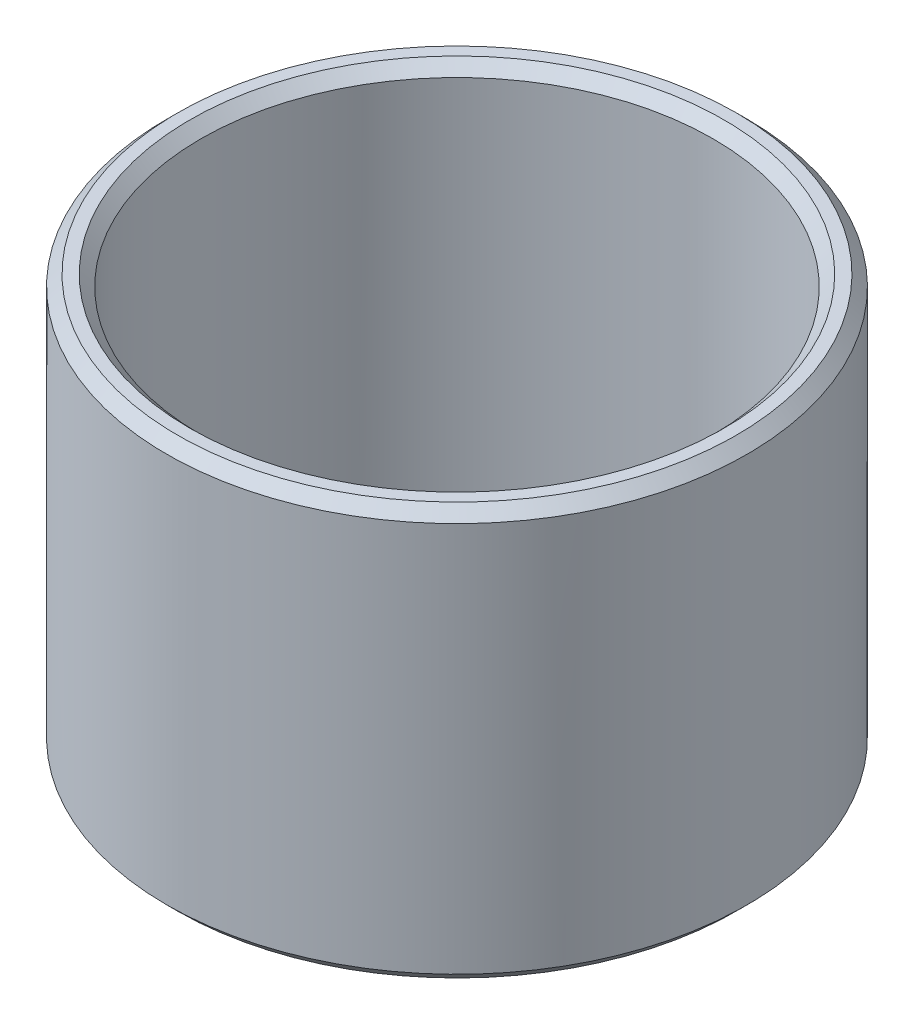
ISO-10303-21;
HEADER;
FILE_DESCRIPTION(('STEP AP214'),'2;1');
FILE_NAME('part.step','',(''),(''),'','','');
FILE_SCHEMA(('AUTOMOTIVE_DESIGN { 1 0 10303 214 1 1 1 1 }'));
ENDSEC;
DATA;
#1=APPLICATION_CONTEXT('core data for automotive mechanical design processes');
#2=APPLICATION_PROTOCOL_DEFINITION('international standard','automotive_design',2000,#1);
#3=PRODUCT_CONTEXT('',#1,'mechanical');
#4=PRODUCT('Part','Part','',(#3));
#5=PRODUCT_RELATED_PRODUCT_CATEGORY('part','',(#4));
#6=PRODUCT_DEFINITION_FORMATION('','',#4);
#7=PRODUCT_DEFINITION_CONTEXT('part definition',#1,'design');
#8=PRODUCT_DEFINITION('design','',#6,#7);
#9=PRODUCT_DEFINITION_SHAPE('','',#8);
#10=(LENGTH_UNIT() NAMED_UNIT(*) SI_UNIT(.MILLI.,.METRE.));
#11=(NAMED_UNIT(*) PLANE_ANGLE_UNIT() SI_UNIT($,.RADIAN.));
#12=(NAMED_UNIT(*) SI_UNIT($,.STERADIAN.) SOLID_ANGLE_UNIT());
#13=UNCERTAINTY_MEASURE_WITH_UNIT(LENGTH_MEASURE(1.E-05),#10,'distance_accuracy_value','');
#14=(GEOMETRIC_REPRESENTATION_CONTEXT(3) GLOBAL_UNCERTAINTY_ASSIGNED_CONTEXT((#13)) GLOBAL_UNIT_ASSIGNED_CONTEXT((#10,
#11,#12)) REPRESENTATION_CONTEXT('',''));
#15=CARTESIAN_POINT('',(0.,0.,0.));
#16=DIRECTION('',(0.,0.,1.));
#17=DIRECTION('',(1.,0.,0.));
#18=AXIS2_PLACEMENT_3D('',#15,#16,#17);
#19=CARTESIAN_POINT('',(0.,70.9984744755506,0.));
#20=DIRECTION('',(0.,-1.,0.));
#21=DIRECTION('',(0.,0.,-1.));
#22=AXIS2_PLACEMENT_3D('',#19,#20,#21);
#23=CYLINDRICAL_SURFACE('',#22,50.);
#24=CARTESIAN_POINT('',(0.,1.88484915004038,0.));
#25=DIRECTION('',(0.,1.,0.));
#26=DIRECTION('',(0.,0.,1.));
#27=AXIS2_PLACEMENT_3D('',#24,#25,#26);
#28=CIRCLE('',#27,50.);
#29=CARTESIAN_POINT('',(0.,1.88484915004038,50.));
#30=VERTEX_POINT('',#29);
#31=EDGE_CURVE('E10',#30,#30,#28,.T.);
#32=ORIENTED_EDGE('',*,*,#31,.T.);
#33=EDGE_LOOP('',(#32));
#34=FACE_BOUND('',#33,.T.);
#35=CARTESIAN_POINT('',(0.,69.1136253255102,0.));
#36=DIRECTION('',(0.,1.,0.));
#37=DIRECTION('',(0.,0.,1.));
#38=AXIS2_PLACEMENT_3D('',#35,#36,#37);
#39=CIRCLE('',#38,50.);
#40=CARTESIAN_POINT('',(0.,69.1136253255102,-50.));
#41=VERTEX_POINT('',#40);
#42=EDGE_CURVE('E50',#41,#41,#39,.F.);
#43=ORIENTED_EDGE('',*,*,#42,.T.);
#44=EDGE_LOOP('',(#43));
#45=FACE_BOUND('',#44,.T.);
#46=ADVANCED_FACE('F39',(#34,#45),#23,.T.);
#47=CARTESIAN_POINT('',(0.,70.9984744755506,0.));
#48=DIRECTION('',(0.,1.,0.));
#49=DIRECTION('',(0.,0.,1.));
#50=AXIS2_PLACEMENT_3D('',#47,#48,#49);
#51=PLANE('',#50);
#52=CARTESIAN_POINT('',(0.,70.9984744755506,0.));
#53=DIRECTION('',(0.,1.,0.));
#54=DIRECTION('',(0.,0.,1.));
#55=AXIS2_PLACEMENT_3D('',#52,#53,#54);
#56=CIRCLE('',#55,46.0154543421442);
#57=CARTESIAN_POINT('',(0.,70.9984744755506,46.0154543421442));
#58=VERTEX_POINT('',#57);
#59=EDGE_CURVE('E58',#58,#58,#56,.F.);
#60=ORIENTED_EDGE('',*,*,#59,.T.);
#61=EDGE_LOOP('',(#60));
#62=FACE_BOUND('',#61,.T.);
#63=CARTESIAN_POINT('',(0.,70.9984744755506,0.));
#64=DIRECTION('',(0.,1.,0.));
#65=DIRECTION('',(0.,0.,1.));
#66=AXIS2_PLACEMENT_3D('',#63,#64,#65);
#67=CIRCLE('',#66,48.1151508499596);
#68=CARTESIAN_POINT('',(0.,70.9984744755506,-48.1151508499596));
#69=VERTEX_POINT('',#68);
#70=EDGE_CURVE('E61',#69,#69,#67,.T.);
#71=ORIENTED_EDGE('',*,*,#70,.T.);
#72=EDGE_LOOP('',(#71));
#73=FACE_BOUND('',#72,.T.);
#74=ADVANCED_FACE('F88',(#62,#73),#51,.T.);
#75=CARTESIAN_POINT('',(0.,0.,0.));
#76=DIRECTION('',(0.,1.,0.));
#77=DIRECTION('',(0.,0.,1.));
#78=AXIS2_PLACEMENT_3D('',#75,#76,#77);
#79=PLANE('',#78);
#80=CARTESIAN_POINT('',(0.,0.,0.));
#81=DIRECTION('',(0.,1.,0.));
#82=DIRECTION('',(0.,0.,1.));
#83=AXIS2_PLACEMENT_3D('',#80,#81,#82);
#84=CIRCLE('',#83,46.0154543421442);
#85=CARTESIAN_POINT('',(0.,0.,-46.0154543421442));
#86=VERTEX_POINT('',#85);
#87=EDGE_CURVE('E51',#86,#86,#84,.T.);
#88=ORIENTED_EDGE('',*,*,#87,.T.);
#89=EDGE_LOOP('',(#88));
#90=FACE_BOUND('',#89,.T.);
#91=CARTESIAN_POINT('',(0.,0.,0.));
#92=DIRECTION('',(0.,1.,0.));
#93=DIRECTION('',(0.,0.,1.));
#94=AXIS2_PLACEMENT_3D('',#91,#92,#93);
#95=CIRCLE('',#94,48.1151508499596);
#96=CARTESIAN_POINT('',(0.,0.,48.1151508499596));
#97=VERTEX_POINT('',#96);
#98=EDGE_CURVE('E54',#97,#97,#95,.F.);
#99=ORIENTED_EDGE('',*,*,#98,.T.);
#100=EDGE_LOOP('',(#99));
#101=FACE_BOUND('',#100,.T.);
#102=ADVANCED_FACE('F83',(#90,#101),#79,.F.);
#103=CARTESIAN_POINT('',(0.,70.9984744755506,0.));
#104=DIRECTION('',(0.,-1.,0.));
#105=DIRECTION('',(0.,0.,-1.));
#106=AXIS2_PLACEMENT_3D('',#103,#104,#105);
#107=CYLINDRICAL_SURFACE('',#106,44.1306051921038);
#108=CARTESIAN_POINT('',(0.,69.1136253255102,0.));
#109=DIRECTION('',(0.,1.,0.));
#110=DIRECTION('',(0.,0.,1.));
#111=AXIS2_PLACEMENT_3D('',#108,#109,#110);
#112=CIRCLE('',#111,44.1306051921038);
#113=CARTESIAN_POINT('',(0.,69.1136253255102,44.1306051921038));
#114=VERTEX_POINT('',#113);
#115=EDGE_CURVE('E67',#114,#114,#112,.T.);
#116=ORIENTED_EDGE('',*,*,#115,.T.);
#117=EDGE_LOOP('',(#116));
#118=FACE_BOUND('',#117,.T.);
#119=CARTESIAN_POINT('',(0.,1.88484915004039,0.));
#120=DIRECTION('',(0.,1.,0.));
#121=DIRECTION('',(0.,0.,1.));
#122=AXIS2_PLACEMENT_3D('',#119,#120,#121);
#123=CIRCLE('',#122,44.1306051921038);
#124=CARTESIAN_POINT('',(0.,1.88484915004039,-44.1306051921038));
#125=VERTEX_POINT('',#124);
#126=EDGE_CURVE('E69',#125,#125,#123,.F.);
#127=ORIENTED_EDGE('',*,*,#126,.T.);
#128=EDGE_LOOP('',(#127));
#129=FACE_BOUND('',#128,.T.);
#130=ADVANCED_FACE('F71',(#118,#129),#107,.F.);
#131=CARTESIAN_POINT('',(0.,69.1136253255102,0.));
#132=DIRECTION('',(0.,1.,0.));
#133=DIRECTION('',(0.,0.,1.));
#134=AXIS2_PLACEMENT_3D('',#131,#132,#133);
#135=CONICAL_SURFACE('',#134,44.1306051921038,0.78539816339745);
#136=ORIENTED_EDGE('',*,*,#59,.F.);
#137=EDGE_LOOP('',(#136));
#138=FACE_BOUND('',#137,.T.);
#139=ORIENTED_EDGE('',*,*,#115,.F.);
#140=EDGE_LOOP('',(#139));
#141=FACE_BOUND('',#140,.T.);
#142=ADVANCED_FACE('F77',(#138,#141),#135,.F.);
#143=CARTESIAN_POINT('',(0.,0.,0.));
#144=DIRECTION('',(0.,-1.,0.));
#145=DIRECTION('',(0.,0.,-1.));
#146=AXIS2_PLACEMENT_3D('',#143,#144,#145);
#147=CONICAL_SURFACE('',#146,46.0154543421442,0.785398163397447);
#148=CARTESIAN_POINT('',(0.,1.88484915004039,-44.1306051921038));
#149=CARTESIAN_POINT('',(0.,1.86521530472747,-44.1502390374167));
#150=CARTESIAN_POINT('',(0.,1.84558145941455,-44.1698728827296));
#151=CARTESIAN_POINT('',(0.,1.80631376878871,-44.2091405733555));
#152=CARTESIAN_POINT('',(0.,1.78667992347579,-44.2287744186684));
#153=CARTESIAN_POINT('',(0.,1.74741223284995,-44.2680421092942));
#154=CARTESIAN_POINT('',(0.,1.72777838753702,-44.2876759546072));
#155=CARTESIAN_POINT('',(0.,1.68851069691118,-44.326943645233));
#156=CARTESIAN_POINT('',(0.,1.66887685159826,-44.3465774905459));
#157=CARTESIAN_POINT('',(0.,1.62960916097242,-44.3858451811718));
#158=CARTESIAN_POINT('',(0.,1.6099753156595,-44.4054790264847));
#159=CARTESIAN_POINT('',(0.,1.57070762503366,-44.4447467171105));
#160=CARTESIAN_POINT('',(0.,1.55107377972074,-44.4643805624235));
#161=CARTESIAN_POINT('',(0.,1.5118060890949,-44.5036482530493));
#162=CARTESIAN_POINT('',(0.,1.49217224378198,-44.5232820983622));
#163=CARTESIAN_POINT('',(0.,1.45290455315613,-44.5625497889881));
#164=CARTESIAN_POINT('',(0.,1.43327070784321,-44.582183634301));
#165=CARTESIAN_POINT('',(0.,1.39400301721737,-44.6214513249268));
#166=CARTESIAN_POINT('',(0.,1.37436917190445,-44.6410851702397));
#167=CARTESIAN_POINT('',(0.,1.33510148127861,-44.6803528608656));
#168=CARTESIAN_POINT('',(0.,1.31546763596569,-44.6999867061785));
#169=CARTESIAN_POINT('',(0.,1.27619994533985,-44.7392543968043));
#170=CARTESIAN_POINT('',(0.,1.25656610002693,-44.7588882421173));
#171=CARTESIAN_POINT('',(0.,1.21729840940109,-44.7981559327431));
#172=CARTESIAN_POINT('',(0.,1.19766456408817,-44.817789778056));
#173=CARTESIAN_POINT('',(0.,1.15839687346232,-44.8570574686819));
#174=CARTESIAN_POINT('',(0.,1.1387630281494,-44.8766913139948));
#175=CARTESIAN_POINT('',(0.,1.09949533752356,-44.9159590046206));
#176=CARTESIAN_POINT('',(0.,1.07986149221064,-44.9355928499335));
#177=CARTESIAN_POINT('',(0.,1.0405938015848,-44.9748605405594));
#178=CARTESIAN_POINT('',(0.,1.02095995627188,-44.9944943858723));
#179=CARTESIAN_POINT('',(0.,0.981692265646036,-45.0337620764982));
#180=CARTESIAN_POINT('',(0.,0.962058420333115,-45.0533959218111));
#181=CARTESIAN_POINT('',(0.,0.922790729707274,-45.0926636124369));
#182=CARTESIAN_POINT('',(0.,0.903156884394354,-45.1122974577498));
#183=CARTESIAN_POINT('',(0.,0.863889193768513,-45.1515651483757));
#184=CARTESIAN_POINT('',(0.,0.844255348455591,-45.1711989936886));
#185=CARTESIAN_POINT('',(0.,0.80498765782975,-45.2104666843144));
#186=CARTESIAN_POINT('',(0.,0.78535381251683,-45.2301005296274));
#187=CARTESIAN_POINT('',(0.,0.746086121890988,-45.2693682202532));
#188=CARTESIAN_POINT('',(0.,0.726452276578067,-45.2890020655661));
#189=CARTESIAN_POINT('',(0.,0.687184585952225,-45.328269756192));
#190=CARTESIAN_POINT('',(0.,0.667550740639306,-45.3479036015049));
#191=CARTESIAN_POINT('',(0.,0.628283050013464,-45.3871712921307));
#192=CARTESIAN_POINT('',(0.,0.608649204700542,-45.4068051374436));
#193=CARTESIAN_POINT('',(0.,0.569381514074701,-45.4460728280695));
#194=CARTESIAN_POINT('',(0.,0.549747668761781,-45.4657066733824));
#195=CARTESIAN_POINT('',(0.,0.51047997813594,-45.5049743640082));
#196=CARTESIAN_POINT('',(0.,0.490846132823018,-45.5246082093212));
#197=CARTESIAN_POINT('',(0.,0.451578442197176,-45.563875899947));
#198=CARTESIAN_POINT('',(0.,0.431944596884257,-45.5835097452599));
#199=CARTESIAN_POINT('',(0.,0.392676906258415,-45.6227774358858));
#200=CARTESIAN_POINT('',(0.,0.373043060945493,-45.6424112811987));
#201=CARTESIAN_POINT('',(0.,0.333775370319652,-45.6816789718245));
#202=CARTESIAN_POINT('',(0.,0.314141525006732,-45.7013128171375));
#203=CARTESIAN_POINT('',(0.,0.274873834380891,-45.7405805077633));
#204=CARTESIAN_POINT('',(0.,0.255239989067969,-45.7602143530762));
#205=CARTESIAN_POINT('',(0.,0.215972298442128,-45.7994820437021));
#206=CARTESIAN_POINT('',(0.,0.196338453129208,-45.819115889015));
#207=CARTESIAN_POINT('',(0.,0.157070762503366,-45.8583835796408));
#208=CARTESIAN_POINT('',(0.,0.137436917190445,-45.8780174249537));
#209=CARTESIAN_POINT('',(0.,0.0981692265646029,-45.9172851155796));
#210=CARTESIAN_POINT('',(0.,0.0785353812516829,-45.9369189608925));
#211=CARTESIAN_POINT('',(0.,0.0392676906258427,-45.9761866515183));
#212=CARTESIAN_POINT('',(0.,0.0196338453129226,-45.9958204968313));
#213=CARTESIAN_POINT('',(0.,0.,-46.0154543421442));
#214=B_SPLINE_CURVE_WITH_KNOTS('',3,(#148,#149,#150,#151,#152,#153,#154,#155,#156,#157,#158,
#159,#160,#161,#162,#163,#164,#165,#166,#167,#168,#169,#170,#171,#172,#173,#174,#175,#176,#177,
#178,#179,#180,#181,#182,#183,#184,#185,#186,#187,#188,#189,#190,#191,#192,#193,#194,#195,#196,
#197,#198,#199,#200,#201,#202,#203,#204,#205,#206,#207,#208,#209,#210,#211,#212,#213),
.UNSPECIFIED.,.F.,.F.,(4,2,2,2,2,2,2,2,2,2,2,2,2,2,2,2,2,2,2,2,2,2,2,2,2,2,2,2,2,2,2,2,4),(0.,
0.0832993509692013,0.166598701938408,0.249898052907609,0.333197403876815,0.416496754846017,
0.499796105815223,0.583095456784424,0.66639480775363,0.749694158722832,0.832993509692038,
0.916292860661239,0.999592211630445,1.08289156259965,1.16619091356885,1.24949026453805,
1.33278961550726,1.41608896647646,1.49938831744566,1.58268766841487,1.66598701938407,
1.74928637035328,1.83258572132248,1.91588507229168,1.99918442326089,2.08248377423009,
2.16578312519929,2.2490824761685,2.3323818271377,2.41568117810691,2.49898052907611,
2.58227988004531,2.66557923101452),.UNSPECIFIED.);
#215=EDGE_CURVE('BSEAM73',#125,#86,#214,.T.);
#216=ORIENTED_EDGE('',*,*,#126,.F.);
#217=ORIENTED_EDGE('',*,*,#87,.F.);
#218=ORIENTED_EDGE('',*,*,#215,.T.);
#219=ORIENTED_EDGE('',*,*,#215,.F.);
#220=EDGE_LOOP('',(#216,#218,#217,#219));
#221=FACE_BOUND('',#220,.T.);
#222=ADVANCED_FACE('F73',(#221),#147,.F.);
#223=CARTESIAN_POINT('',(0.,1.88484915004038,0.));
#224=DIRECTION('',(0.,1.,0.));
#225=DIRECTION('',(0.,0.,1.));
#226=AXIS2_PLACEMENT_3D('',#223,#224,#225);
#227=CONICAL_SURFACE('',#226,50.,0.78539816339745);
#228=ORIENTED_EDGE('',*,*,#98,.F.);
#229=EDGE_LOOP('',(#228));
#230=FACE_BOUND('',#229,.T.);
#231=ORIENTED_EDGE('',*,*,#31,.F.);
#232=EDGE_LOOP('',(#231));
#233=FACE_BOUND('',#232,.T.);
#234=ADVANCED_FACE('F76',(#230,#233),#227,.T.);
#235=CARTESIAN_POINT('',(0.,70.9984744755506,0.));
#236=DIRECTION('',(0.,-1.,0.));
#237=DIRECTION('',(0.,0.,-1.));
#238=AXIS2_PLACEMENT_3D('',#235,#236,#237);
#239=CONICAL_SURFACE('',#238,48.1151508499596,0.785398163397447);
#240=CARTESIAN_POINT('',(0.,69.1136253255102,-50.));
#241=CARTESIAN_POINT('',(0.,69.1332591708231,-49.9803661546871));
#242=CARTESIAN_POINT('',(0.,69.152893016136,-49.9607323093742));
#243=CARTESIAN_POINT('',(0.,69.1921607067619,-49.9214646187483));
#244=CARTESIAN_POINT('',(0.,69.2117945520748,-49.9018307734354));
#245=CARTESIAN_POINT('',(0.,69.2510622427006,-49.8625630828096));
#246=CARTESIAN_POINT('',(0.,69.2706960880136,-49.8429292374966));
#247=CARTESIAN_POINT('',(0.,69.3099637786394,-49.8036615468708));
#248=CARTESIAN_POINT('',(0.,69.3295976239523,-49.7840277015579));
#249=CARTESIAN_POINT('',(0.,69.3688653145781,-49.744760010932));
#250=CARTESIAN_POINT('',(0.,69.3884991598911,-49.7251261656191));
#251=CARTESIAN_POINT('',(0.,69.4277668505169,-49.6858584749933));
#252=CARTESIAN_POINT('',(0.,69.4474006958298,-49.6662246296804));
#253=CARTESIAN_POINT('',(0.,69.4866683864557,-49.6269569390545));
#254=CARTESIAN_POINT('',(0.,69.5063022317686,-49.6073230937416));
#255=CARTESIAN_POINT('',(0.,69.5455699223944,-49.5680554031158));
#256=CARTESIAN_POINT('',(0.,69.5652037677073,-49.5484215578028));
#257=CARTESIAN_POINT('',(0.,69.6044714583332,-49.509153867177));
#258=CARTESIAN_POINT('',(0.,69.6241053036461,-49.4895200218641));
#259=CARTESIAN_POINT('',(0.,69.663372994272,-49.4502523312382));
#260=CARTESIAN_POINT('',(0.,69.6830068395849,-49.4306184859253));
#261=CARTESIAN_POINT('',(0.,69.7222745302107,-49.3913507952995));
#262=CARTESIAN_POINT('',(0.,69.7419083755236,-49.3717169499865));
#263=CARTESIAN_POINT('',(0.,69.7811760661495,-49.3324492593607));
#264=CARTESIAN_POINT('',(0.,69.8008099114624,-49.3128154140478));
#265=CARTESIAN_POINT('',(0.,69.8400776020882,-49.2735477234219));
#266=CARTESIAN_POINT('',(0.,69.8597114474012,-49.253913878109));
#267=CARTESIAN_POINT('',(0.,69.898979138027,-49.2146461874832));
#268=CARTESIAN_POINT('',(0.,69.9186129833399,-49.1950123421703));
#269=CARTESIAN_POINT('',(0.,69.9578806739658,-49.1557446515444));
#270=CARTESIAN_POINT('',(0.,69.9775145192787,-49.1361108062315));
#271=CARTESIAN_POINT('',(0.,70.0167822099045,-49.0968431156057));
#272=CARTESIAN_POINT('',(0.,70.0364160552174,-49.0772092702927));
#273=CARTESIAN_POINT('',(0.,70.0756837458433,-49.0379415796669));
#274=CARTESIAN_POINT('',(0.,70.0953175911562,-49.018307734354));
#275=CARTESIAN_POINT('',(0.,70.1345852817821,-48.9790400437281));
#276=CARTESIAN_POINT('',(0.,70.154219127095,-48.9594061984152));
#277=CARTESIAN_POINT('',(0.,70.1934868177208,-48.9201385077894));
#278=CARTESIAN_POINT('',(0.,70.2131206630337,-48.9005046624765));
#279=CARTESIAN_POINT('',(0.,70.2523883536596,-48.8612369718506));
#280=CARTESIAN_POINT('',(0.,70.2720221989725,-48.8416031265377));
#281=CARTESIAN_POINT('',(0.,70.3112898895983,-48.8023354359118));
#282=CARTESIAN_POINT('',(0.,70.3309237349113,-48.7827015905989));
#283=CARTESIAN_POINT('',(0.,70.3701914255371,-48.7434338999731));
#284=CARTESIAN_POINT('',(0.,70.38982527085,-48.7238000546602));
#285=CARTESIAN_POINT('',(0.,70.4290929614759,-48.6845323640343));
#286=CARTESIAN_POINT('',(0.,70.4487268067888,-48.6648985187214));
#287=CARTESIAN_POINT('',(0.,70.4879944974146,-48.6256308280956));
#288=CARTESIAN_POINT('',(0.,70.5076283427276,-48.6059969827826));
#289=CARTESIAN_POINT('',(0.,70.5468960333534,-48.5667292921568));
#290=CARTESIAN_POINT('',(0.,70.5665298786663,-48.5470954468439));
#291=CARTESIAN_POINT('',(0.,70.6057975692922,-48.507827756218));
#292=CARTESIAN_POINT('',(0.,70.6254314146051,-48.4881939109051));
#293=CARTESIAN_POINT('',(0.,70.6646991052309,-48.4489262202793));
#294=CARTESIAN_POINT('',(0.,70.6843329505438,-48.4292923749664));
#295=CARTESIAN_POINT('',(0.,70.7236006411697,-48.3900246843405));
#296=CARTESIAN_POINT('',(0.,70.7432344864826,-48.3703908390276));
#297=CARTESIAN_POINT('',(0.,70.7825021771085,-48.3311231484018));
#298=CARTESIAN_POINT('',(0.,70.8021360224214,-48.3114893030888));
#299=CARTESIAN_POINT('',(0.,70.8414037130472,-48.272221612463));
#300=CARTESIAN_POINT('',(0.,70.8610375583601,-48.2525877671501));
#301=CARTESIAN_POINT('',(0.,70.900305248986,-48.2133200765242));
#302=CARTESIAN_POINT('',(0.,70.9199390942989,-48.1936862312113));
#303=CARTESIAN_POINT('',(0.,70.9592067849247,-48.1544185405855));
#304=CARTESIAN_POINT('',(0.,70.9788406302377,-48.1347846952725));
#305=CARTESIAN_POINT('',(0.,70.9984744755506,-48.1151508499596));
#306=B_SPLINE_CURVE_WITH_KNOTS('',3,(#240,#241,#242,#243,#244,#245,#246,#247,#248,#249,#250,
#251,#252,#253,#254,#255,#256,#257,#258,#259,#260,#261,#262,#263,#264,#265,#266,#267,#268,#269,
#270,#271,#272,#273,#274,#275,#276,#277,#278,#279,#280,#281,#282,#283,#284,#285,#286,#287,#288,
#289,#290,#291,#292,#293,#294,#295,#296,#297,#298,#299,#300,#301,#302,#303,#304,#305),
.UNSPECIFIED.,.F.,.F.,(4,2,2,2,2,2,2,2,2,2,2,2,2,2,2,2,2,2,2,2,2,2,2,2,2,2,2,2,2,2,2,2,4),(0.,
0.0832993509692038,0.166598701938412,0.249898052907616,0.333197403876815,0.416496754846019,
0.499796105815228,0.583095456784431,0.66639480775363,0.749694158722834,0.832993509692043,
0.916292860661247,0.999592211630445,1.08289156259965,1.16619091356886,1.24949026453806,
1.33278961550726,1.41608896647646,1.49938831744567,1.58268766841488,1.66598701938407,
1.74928637035328,1.83258572132248,1.91588507229169,1.9991844232609,2.0824837742301,
2.1657831251993,2.24908247616851,2.33238182713771,2.41568117810691,2.49898052907611,
2.58227988004532,2.66557923101453),.UNSPECIFIED.);
#307=EDGE_CURVE('BSEAM45',#41,#69,#306,.T.);
#308=ORIENTED_EDGE('',*,*,#42,.F.);
#309=ORIENTED_EDGE('',*,*,#70,.F.);
#310=ORIENTED_EDGE('',*,*,#307,.T.);
#311=ORIENTED_EDGE('',*,*,#307,.F.);
#312=EDGE_LOOP('',(#308,#310,#309,#311));
#313=FACE_BOUND('',#312,.T.);
#314=ADVANCED_FACE('F45',(#313),#239,.T.);
#315=CLOSED_SHELL('',(#46,#74,#102,#130,#142,#222,#234,#314));
#316=MANIFOLD_SOLID_BREP('B2',#315);
#317=ADVANCED_BREP_SHAPE_REPRESENTATION('',(#18,#316),#14);
#318=SHAPE_DEFINITION_REPRESENTATION(#9,#317);
ENDSEC;
END-ISO-10303-21;
